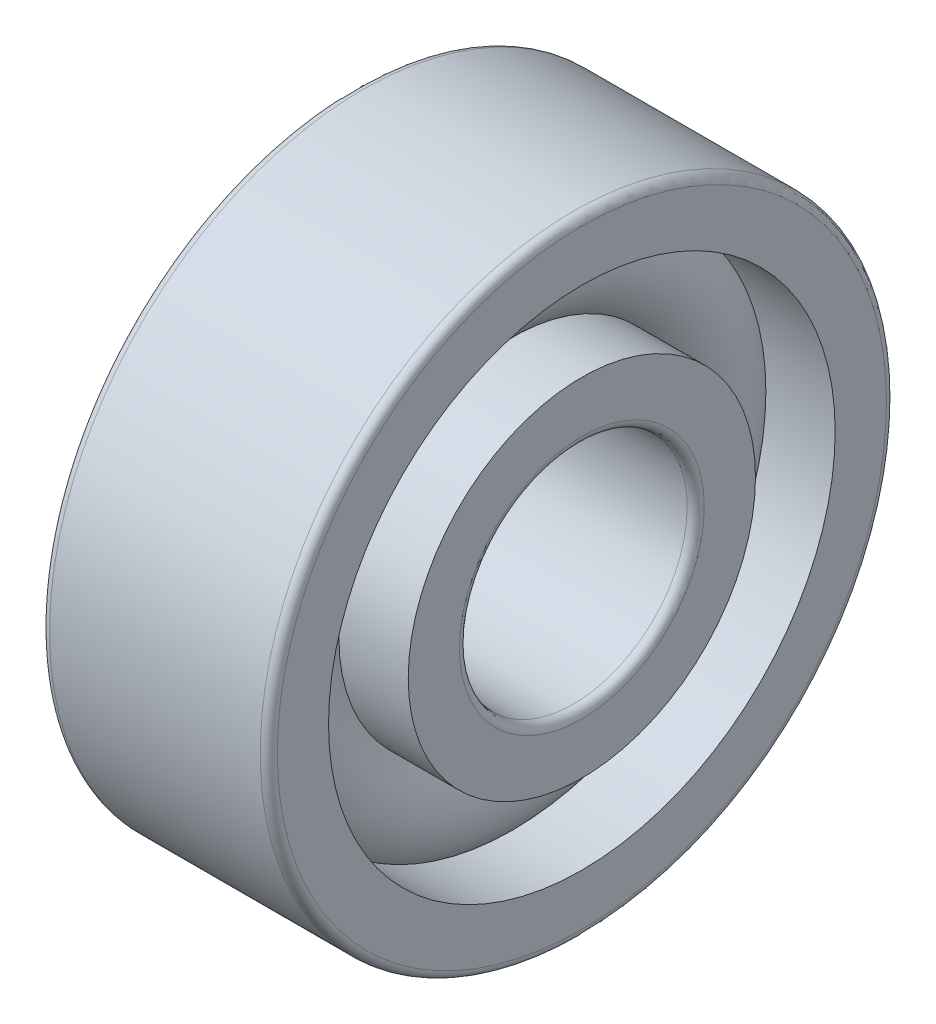
ISO-10303-21;
HEADER;
FILE_DESCRIPTION(('STEP AP214'),'2;1');
FILE_NAME('part.step','',(''),(''),'','','');
FILE_SCHEMA(('AUTOMOTIVE_DESIGN { 1 0 10303 214 1 1 1 1 }'));
ENDSEC;
DATA;
#1=APPLICATION_CONTEXT('core data for automotive mechanical design processes');
#2=APPLICATION_PROTOCOL_DEFINITION('international standard','automotive_design',2000,#1);
#3=PRODUCT_CONTEXT('',#1,'mechanical');
#4=PRODUCT('Part','Part','',(#3));
#5=PRODUCT_RELATED_PRODUCT_CATEGORY('part','',(#4));
#6=PRODUCT_DEFINITION_FORMATION('','',#4);
#7=PRODUCT_DEFINITION_CONTEXT('part definition',#1,'design');
#8=PRODUCT_DEFINITION('design','',#6,#7);
#9=PRODUCT_DEFINITION_SHAPE('','',#8);
#10=(LENGTH_UNIT() NAMED_UNIT(*) SI_UNIT(.MILLI.,.METRE.));
#11=(NAMED_UNIT(*) PLANE_ANGLE_UNIT() SI_UNIT($,.RADIAN.));
#12=(NAMED_UNIT(*) SI_UNIT($,.STERADIAN.) SOLID_ANGLE_UNIT());
#13=UNCERTAINTY_MEASURE_WITH_UNIT(LENGTH_MEASURE(1.E-05),#10,'distance_accuracy_value','');
#14=(GEOMETRIC_REPRESENTATION_CONTEXT(3) GLOBAL_UNCERTAINTY_ASSIGNED_CONTEXT((#13)) GLOBAL_UNIT_ASSIGNED_CONTEXT((#10,
#11,#12)) REPRESENTATION_CONTEXT('',''));
#15=CARTESIAN_POINT('',(0.,0.,0.));
#16=DIRECTION('',(0.,0.,1.));
#17=DIRECTION('',(1.,0.,0.));
#18=AXIS2_PLACEMENT_3D('',#15,#16,#17);
#19=CARTESIAN_POINT('',(0.,0.,0.));
#20=DIRECTION('',(-1.,0.,0.));
#21=DIRECTION('',(0.,0.,1.));
#22=AXIS2_PLACEMENT_3D('',#19,#20,#21);
#23=TOROIDAL_SURFACE('',#22,3.75,1.05);
#24=CARTESIAN_POINT('',(0.782623792124922,0.,0.));
#25=DIRECTION('',(-1.,0.,0.));
#26=DIRECTION('',(0.,0.,1.));
#27=AXIS2_PLACEMENT_3D('',#24,#25,#26);
#28=CIRCLE('',#27,4.45000000000001);
#29=CARTESIAN_POINT('',(0.782623792124922,0.,4.45000000000001));
#30=VERTEX_POINT('',#29);
#31=EDGE_CURVE('E45',#30,#30,#28,.F.);
#32=ORIENTED_EDGE('',*,*,#31,.T.);
#33=EDGE_LOOP('',(#32));
#34=FACE_BOUND('',#33,.T.);
#35=CARTESIAN_POINT('',(0.782623792124926,0.,0.));
#36=DIRECTION('',(-1.,0.,0.));
#37=DIRECTION('',(0.,0.,1.));
#38=AXIS2_PLACEMENT_3D('',#35,#36,#37);
#39=CIRCLE('',#38,3.05);
#40=CARTESIAN_POINT('',(0.782623792124926,0.,3.05));
#41=VERTEX_POINT('',#40);
#42=EDGE_CURVE('E10',#41,#41,#39,.T.);
#43=ORIENTED_EDGE('',*,*,#42,.T.);
#44=EDGE_LOOP('',(#43));
#45=FACE_BOUND('',#44,.T.);
#46=ADVANCED_FACE('F41',(#34,#45),#23,.T.);
#47=CARTESIAN_POINT('',(-20.6375,0.,0.));
#48=DIRECTION('',(1.,0.,0.));
#49=DIRECTION('',(0.,0.,-1.));
#50=AXIS2_PLACEMENT_3D('',#47,#48,#49);
#51=CYLINDRICAL_SURFACE('',#50,3.05);
#52=CARTESIAN_POINT('',(2.,0.,0.));
#53=DIRECTION('',(1.,0.,0.));
#54=DIRECTION('',(0.,0.,-1.));
#55=AXIS2_PLACEMENT_3D('',#52,#53,#54);
#56=CIRCLE('',#55,3.05);
#57=CARTESIAN_POINT('',(2.,0.,-3.05));
#58=VERTEX_POINT('',#57);
#59=EDGE_CURVE('E56',#58,#58,#56,.T.);
#60=ORIENTED_EDGE('',*,*,#59,.F.);
#61=EDGE_LOOP('',(#60));
#62=FACE_BOUND('',#61,.T.);
#63=ORIENTED_EDGE('',*,*,#42,.F.);
#64=EDGE_LOOP('',(#63));
#65=FACE_BOUND('',#64,.T.);
#66=ADVANCED_FACE('F105',(#62,#65),#51,.T.);
#67=CARTESIAN_POINT('',(-20.6375,0.,0.));
#68=DIRECTION('',(1.,0.,0.));
#69=DIRECTION('',(0.,0.,-1.));
#70=AXIS2_PLACEMENT_3D('',#67,#68,#69);
#71=CYLINDRICAL_SURFACE('',#70,3.05);
#72=CARTESIAN_POINT('',(-2.,0.,0.));
#73=DIRECTION('',(1.,0.,0.));
#74=DIRECTION('',(0.,0.,-1.));
#75=AXIS2_PLACEMENT_3D('',#72,#73,#74);
#76=CIRCLE('',#75,3.05);
#77=CARTESIAN_POINT('',(-2.,0.,-3.05));
#78=VERTEX_POINT('',#77);
#79=EDGE_CURVE('E68',#78,#78,#76,.T.);
#80=ORIENTED_EDGE('',*,*,#79,.T.);
#81=EDGE_LOOP('',(#80));
#82=FACE_BOUND('',#81,.T.);
#83=CARTESIAN_POINT('',(-0.782623792124926,0.,0.));
#84=DIRECTION('',(1.,0.,0.));
#85=DIRECTION('',(0.,0.,-1.));
#86=AXIS2_PLACEMENT_3D('',#83,#84,#85);
#87=CIRCLE('',#86,3.05);
#88=CARTESIAN_POINT('',(-0.782623792124926,0.,-3.05));
#89=VERTEX_POINT('',#88);
#90=EDGE_CURVE('E50',#89,#89,#87,.T.);
#91=ORIENTED_EDGE('',*,*,#90,.F.);
#92=EDGE_LOOP('',(#91));
#93=FACE_BOUND('',#92,.T.);
#94=ADVANCED_FACE('F108',(#82,#93),#71,.T.);
#95=CARTESIAN_POINT('',(2.,2.15,0.));
#96=DIRECTION('',(1.,0.,0.));
#97=DIRECTION('',(0.,0.,-1.));
#98=AXIS2_PLACEMENT_3D('',#95,#96,#97);
#99=PLANE('',#98);
#100=ORIENTED_EDGE('',*,*,#59,.T.);
#101=EDGE_LOOP('',(#100));
#102=FACE_BOUND('',#101,.T.);
#103=CARTESIAN_POINT('',(2.,0.,0.));
#104=DIRECTION('',(1.,0.,0.));
#105=DIRECTION('',(0.,0.,-1.));
#106=AXIS2_PLACEMENT_3D('',#103,#104,#105);
#107=CIRCLE('',#106,2.15);
#108=CARTESIAN_POINT('',(2.,0.,-2.15));
#109=VERTEX_POINT('',#108);
#110=EDGE_CURVE('E95',#109,#109,#107,.T.);
#111=ORIENTED_EDGE('',*,*,#110,.F.);
#112=EDGE_LOOP('',(#111));
#113=FACE_BOUND('',#112,.T.);
#114=ADVANCED_FACE('F102',(#102,#113),#99,.T.);
#115=CARTESIAN_POINT('',(1.85,0.,0.));
#116=DIRECTION('',(1.,0.,0.));
#117=DIRECTION('',(0.,0.,-1.));
#118=AXIS2_PLACEMENT_3D('',#115,#116,#117);
#119=TOROIDAL_SURFACE('',#118,2.15,0.15);
#120=ORIENTED_EDGE('',*,*,#110,.T.);
#121=EDGE_LOOP('',(#120));
#122=FACE_BOUND('',#121,.T.);
#123=CARTESIAN_POINT('',(1.85,0.,0.));
#124=DIRECTION('',(1.,0.,0.));
#125=DIRECTION('',(0.,0.,-1.));
#126=AXIS2_PLACEMENT_3D('',#123,#124,#125);
#127=CIRCLE('',#126,2.);
#128=CARTESIAN_POINT('',(1.85,0.,-2.));
#129=VERTEX_POINT('',#128);
#130=EDGE_CURVE('E91',#129,#129,#127,.T.);
#131=ORIENTED_EDGE('',*,*,#130,.F.);
#132=EDGE_LOOP('',(#131));
#133=FACE_BOUND('',#132,.T.);
#134=ADVANCED_FACE('F119',(#122,#133),#119,.T.);
#135=CARTESIAN_POINT('',(-20.6375,0.,0.));
#136=DIRECTION('',(1.,0.,0.));
#137=DIRECTION('',(0.,0.,-1.));
#138=AXIS2_PLACEMENT_3D('',#135,#136,#137);
#139=CYLINDRICAL_SURFACE('',#138,2.);
#140=ORIENTED_EDGE('',*,*,#130,.T.);
#141=EDGE_LOOP('',(#140));
#142=FACE_BOUND('',#141,.T.);
#143=CARTESIAN_POINT('',(-1.85,0.,0.));
#144=DIRECTION('',(1.,0.,0.));
#145=DIRECTION('',(0.,0.,-1.));
#146=AXIS2_PLACEMENT_3D('',#143,#144,#145);
#147=CIRCLE('',#146,2.);
#148=CARTESIAN_POINT('',(-1.85,0.,-2.));
#149=VERTEX_POINT('',#148);
#150=EDGE_CURVE('E87',#149,#149,#147,.T.);
#151=ORIENTED_EDGE('',*,*,#150,.F.);
#152=EDGE_LOOP('',(#151));
#153=FACE_BOUND('',#152,.T.);
#154=ADVANCED_FACE('F122',(#142,#153),#139,.F.);
#155=CARTESIAN_POINT('',(-1.85,0.,0.));
#156=DIRECTION('',(1.,0.,0.));
#157=DIRECTION('',(0.,0.,-1.));
#158=AXIS2_PLACEMENT_3D('',#155,#156,#157);
#159=TOROIDAL_SURFACE('',#158,2.15,0.15);
#160=ORIENTED_EDGE('',*,*,#150,.T.);
#161=EDGE_LOOP('',(#160));
#162=FACE_BOUND('',#161,.T.);
#163=CARTESIAN_POINT('',(-2.,0.,0.));
#164=DIRECTION('',(1.,0.,0.));
#165=DIRECTION('',(0.,0.,-1.));
#166=AXIS2_PLACEMENT_3D('',#163,#164,#165);
#167=CIRCLE('',#166,2.15);
#168=CARTESIAN_POINT('',(-2.,0.,-2.15));
#169=VERTEX_POINT('',#168);
#170=EDGE_CURVE('E83',#169,#169,#167,.T.);
#171=ORIENTED_EDGE('',*,*,#170,.F.);
#172=EDGE_LOOP('',(#171));
#173=FACE_BOUND('',#172,.T.);
#174=ADVANCED_FACE('F126',(#162,#173),#159,.T.);
#175=CARTESIAN_POINT('',(-2.,3.05,0.));
#176=DIRECTION('',(-1.,0.,0.));
#177=DIRECTION('',(0.,0.,1.));
#178=AXIS2_PLACEMENT_3D('',#175,#176,#177);
#179=PLANE('',#178);
#180=ORIENTED_EDGE('',*,*,#170,.T.);
#181=EDGE_LOOP('',(#180));
#182=FACE_BOUND('',#181,.T.);
#183=ORIENTED_EDGE('',*,*,#79,.F.);
#184=EDGE_LOOP('',(#183));
#185=FACE_BOUND('',#184,.T.);
#186=ADVANCED_FACE('F130',(#182,#185),#179,.T.);
#187=CARTESIAN_POINT('',(-0.782623792124922,0.,0.));
#188=DIRECTION('',(1.,0.,0.));
#189=DIRECTION('',(0.,0.,-1.));
#190=AXIS2_PLACEMENT_3D('',#187,#188,#189);
#191=CIRCLE('',#190,4.45000000000001);
#192=CARTESIAN_POINT('',(-0.782623792124922,0.,-4.45000000000001));
#193=VERTEX_POINT('',#192);
#194=EDGE_CURVE('E59',#193,#193,#191,.F.);
#195=ORIENTED_EDGE('',*,*,#194,.T.);
#196=EDGE_LOOP('',(#195));
#197=FACE_BOUND('',#196,.T.);
#198=ORIENTED_EDGE('',*,*,#90,.T.);
#199=EDGE_LOOP('',(#198));
#200=FACE_BOUND('',#199,.T.);
#201=ADVANCED_FACE('F43',(#197,#200),#23,.T.);
#202=CARTESIAN_POINT('',(-20.6375,0.,0.));
#203=DIRECTION('',(1.,0.,0.));
#204=DIRECTION('',(0.,0.,-1.));
#205=AXIS2_PLACEMENT_3D('',#202,#203,#204);
#206=CYLINDRICAL_SURFACE('',#205,4.45000000000001);
#207=CARTESIAN_POINT('',(2.,0.,0.));
#208=DIRECTION('',(1.,0.,0.));
#209=DIRECTION('',(0.,0.,-1.));
#210=AXIS2_PLACEMENT_3D('',#207,#208,#209);
#211=CIRCLE('',#210,4.45000000000001);
#212=CARTESIAN_POINT('',(2.,0.,-4.45000000000001));
#213=VERTEX_POINT('',#212);
#214=EDGE_CURVE('E62',#213,#213,#211,.T.);
#215=ORIENTED_EDGE('',*,*,#214,.T.);
#216=EDGE_LOOP('',(#215));
#217=FACE_BOUND('',#216,.T.);
#218=ORIENTED_EDGE('',*,*,#31,.F.);
#219=EDGE_LOOP('',(#218));
#220=FACE_BOUND('',#219,.T.);
#221=ADVANCED_FACE('F135',(#217,#220),#206,.F.);
#222=CARTESIAN_POINT('',(-20.6375,0.,0.));
#223=DIRECTION('',(1.,0.,0.));
#224=DIRECTION('',(0.,0.,-1.));
#225=AXIS2_PLACEMENT_3D('',#222,#223,#224);
#226=CYLINDRICAL_SURFACE('',#225,4.45000000000001);
#227=CARTESIAN_POINT('',(-2.,0.,0.));
#228=DIRECTION('',(1.,0.,0.));
#229=DIRECTION('',(0.,0.,-1.));
#230=AXIS2_PLACEMENT_3D('',#227,#228,#229);
#231=CIRCLE('',#230,4.45000000000001);
#232=CARTESIAN_POINT('',(-2.,0.,-4.45000000000001));
#233=VERTEX_POINT('',#232);
#234=EDGE_CURVE('E166',#233,#233,#231,.T.);
#235=ORIENTED_EDGE('',*,*,#234,.F.);
#236=EDGE_LOOP('',(#235));
#237=FACE_BOUND('',#236,.T.);
#238=ORIENTED_EDGE('',*,*,#194,.F.);
#239=EDGE_LOOP('',(#238));
#240=FACE_BOUND('',#239,.T.);
#241=ADVANCED_FACE('F138',(#237,#240),#226,.F.);
#242=CARTESIAN_POINT('',(2.,5.35,0.));
#243=DIRECTION('',(1.,0.,0.));
#244=DIRECTION('',(0.,0.,-1.));
#245=AXIS2_PLACEMENT_3D('',#242,#243,#244);
#246=PLANE('',#245);
#247=CARTESIAN_POINT('',(2.,0.,0.));
#248=DIRECTION('',(1.,0.,0.));
#249=DIRECTION('',(0.,0.,-1.));
#250=AXIS2_PLACEMENT_3D('',#247,#248,#249);
#251=CIRCLE('',#250,5.35);
#252=CARTESIAN_POINT('',(2.,0.,-5.35));
#253=VERTEX_POINT('',#252);
#254=EDGE_CURVE('E70',#253,#253,#251,.T.);
#255=ORIENTED_EDGE('',*,*,#254,.T.);
#256=EDGE_LOOP('',(#255));
#257=FACE_BOUND('',#256,.T.);
#258=ORIENTED_EDGE('',*,*,#214,.F.);
#259=EDGE_LOOP('',(#258));
#260=FACE_BOUND('',#259,.T.);
#261=ADVANCED_FACE('F139',(#257,#260),#246,.T.);
#262=CARTESIAN_POINT('',(1.85,0.,0.));
#263=DIRECTION('',(1.,0.,0.));
#264=DIRECTION('',(0.,0.,-1.));
#265=AXIS2_PLACEMENT_3D('',#262,#263,#264);
#266=TOROIDAL_SURFACE('',#265,5.35,0.149999999999999);
#267=CARTESIAN_POINT('',(1.85,0.,0.));
#268=DIRECTION('',(1.,0.,0.));
#269=DIRECTION('',(0.,0.,-1.));
#270=AXIS2_PLACEMENT_3D('',#267,#268,#269);
#271=CIRCLE('',#270,5.5);
#272=CARTESIAN_POINT('',(1.85,0.,-5.5));
#273=VERTEX_POINT('',#272);
#274=EDGE_CURVE('E76',#273,#273,#271,.T.);
#275=ORIENTED_EDGE('',*,*,#274,.T.);
#276=EDGE_LOOP('',(#275));
#277=FACE_BOUND('',#276,.T.);
#278=ORIENTED_EDGE('',*,*,#254,.F.);
#279=EDGE_LOOP('',(#278));
#280=FACE_BOUND('',#279,.T.);
#281=ADVANCED_FACE('F142',(#277,#280),#266,.T.);
#282=CARTESIAN_POINT('',(-20.6375,0.,0.));
#283=DIRECTION('',(1.,0.,0.));
#284=DIRECTION('',(0.,0.,-1.));
#285=AXIS2_PLACEMENT_3D('',#282,#283,#284);
#286=CYLINDRICAL_SURFACE('',#285,5.5);
#287=CARTESIAN_POINT('',(-1.85,0.,0.));
#288=DIRECTION('',(1.,0.,0.));
#289=DIRECTION('',(0.,0.,-1.));
#290=AXIS2_PLACEMENT_3D('',#287,#288,#289);
#291=CIRCLE('',#290,5.5);
#292=CARTESIAN_POINT('',(-1.85,0.,-5.5));
#293=VERTEX_POINT('',#292);
#294=EDGE_CURVE('E172',#293,#293,#291,.T.);
#295=ORIENTED_EDGE('',*,*,#294,.T.);
#296=EDGE_LOOP('',(#295));
#297=FACE_BOUND('',#296,.T.);
#298=ORIENTED_EDGE('',*,*,#274,.F.);
#299=EDGE_LOOP('',(#298));
#300=FACE_BOUND('',#299,.T.);
#301=ADVANCED_FACE('F146',(#297,#300),#286,.T.);
#302=CARTESIAN_POINT('',(-1.85,0.,0.));
#303=DIRECTION('',(1.,0.,0.));
#304=DIRECTION('',(0.,0.,-1.));
#305=AXIS2_PLACEMENT_3D('',#302,#303,#304);
#306=TOROIDAL_SURFACE('',#305,5.35,0.149999999999999);
#307=CARTESIAN_POINT('',(-2.,0.,0.));
#308=DIRECTION('',(1.,0.,0.));
#309=DIRECTION('',(0.,0.,-1.));
#310=AXIS2_PLACEMENT_3D('',#307,#308,#309);
#311=CIRCLE('',#310,5.35);
#312=CARTESIAN_POINT('',(-2.,0.,-5.35));
#313=VERTEX_POINT('',#312);
#314=EDGE_CURVE('E168',#313,#313,#311,.T.);
#315=ORIENTED_EDGE('',*,*,#314,.T.);
#316=EDGE_LOOP('',(#315));
#317=FACE_BOUND('',#316,.T.);
#318=ORIENTED_EDGE('',*,*,#294,.F.);
#319=EDGE_LOOP('',(#318));
#320=FACE_BOUND('',#319,.T.);
#321=ADVANCED_FACE('F150',(#317,#320),#306,.T.);
#322=CARTESIAN_POINT('',(-2.,4.45000000000001,0.));
#323=DIRECTION('',(-1.,0.,0.));
#324=DIRECTION('',(0.,0.,1.));
#325=AXIS2_PLACEMENT_3D('',#322,#323,#324);
#326=PLANE('',#325);
#327=ORIENTED_EDGE('',*,*,#234,.T.);
#328=EDGE_LOOP('',(#327));
#329=FACE_BOUND('',#328,.T.);
#330=ORIENTED_EDGE('',*,*,#314,.F.);
#331=EDGE_LOOP('',(#330));
#332=FACE_BOUND('',#331,.T.);
#333=ADVANCED_FACE('F154',(#329,#332),#326,.T.);
#334=CLOSED_SHELL('',(#46,#66,#94,#114,#134,#154,#174,#186,#201,#221,#241,#261,#281,#301,#321,#333));
#335=MANIFOLD_SOLID_BREP('B2',#334);
#336=ADVANCED_BREP_SHAPE_REPRESENTATION('',(#18,#335),#14);
#337=SHAPE_DEFINITION_REPRESENTATION(#9,#336);
ENDSEC;
END-ISO-10303-21;
